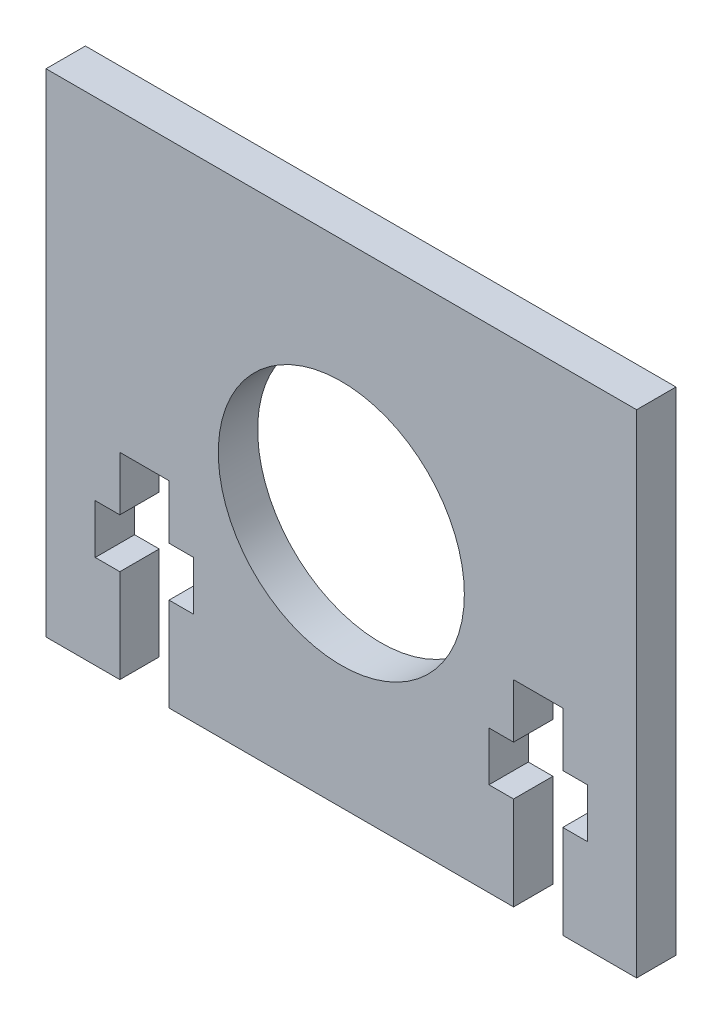
ISO-10303-21;
HEADER;
FILE_DESCRIPTION(('STEP AP214'),'2;1');
FILE_NAME('part.step','',(''),(''),'','','');
FILE_SCHEMA(('AUTOMOTIVE_DESIGN { 1 0 10303 214 1 1 1 1 }'));
ENDSEC;
DATA;
#1=APPLICATION_CONTEXT('core data for automotive mechanical design processes');
#2=APPLICATION_PROTOCOL_DEFINITION('international standard','automotive_design',2000,#1);
#3=PRODUCT_CONTEXT('',#1,'mechanical');
#4=PRODUCT('Part','Part','',(#3));
#5=PRODUCT_RELATED_PRODUCT_CATEGORY('part','',(#4));
#6=PRODUCT_DEFINITION_FORMATION('','',#4);
#7=PRODUCT_DEFINITION_CONTEXT('part definition',#1,'design');
#8=PRODUCT_DEFINITION('design','',#6,#7);
#9=PRODUCT_DEFINITION_SHAPE('','',#8);
#10=(LENGTH_UNIT() NAMED_UNIT(*) SI_UNIT(.MILLI.,.METRE.));
#11=(NAMED_UNIT(*) PLANE_ANGLE_UNIT() SI_UNIT($,.RADIAN.));
#12=(NAMED_UNIT(*) SI_UNIT($,.STERADIAN.) SOLID_ANGLE_UNIT());
#13=UNCERTAINTY_MEASURE_WITH_UNIT(LENGTH_MEASURE(1.E-05),#10,'distance_accuracy_value','');
#14=(GEOMETRIC_REPRESENTATION_CONTEXT(3) GLOBAL_UNCERTAINTY_ASSIGNED_CONTEXT((#13)) GLOBAL_UNIT_ASSIGNED_CONTEXT((#10,
#11,#12)) REPRESENTATION_CONTEXT('',''));
#15=CARTESIAN_POINT('',(0.,0.,0.));
#16=DIRECTION('',(0.,0.,1.));
#17=DIRECTION('',(1.,0.,0.));
#18=AXIS2_PLACEMENT_3D('',#15,#16,#17);
#19=CARTESIAN_POINT('',(30.,-24.9999999999997,4.));
#20=DIRECTION('',(0.,1.,0.));
#21=DIRECTION('',(-1.,0.,0.));
#22=AXIS2_PLACEMENT_3D('',#19,#20,#21);
#23=PLANE('',#22);
#24=DIRECTION('',(1.,0.,0.));
#25=VECTOR('',#24,1.);
#26=CARTESIAN_POINT('',(30.,-24.9999999999997,0.));
#27=LINE('',#26,#25);
#28=CARTESIAN_POINT('',(-17.5,-24.9999999999997,0.));
#29=VERTEX_POINT('',#28);
#30=CARTESIAN_POINT('',(17.5,-24.9999999999997,0.));
#31=VERTEX_POINT('',#30);
#32=EDGE_CURVE('E237',#29,#31,#27,.T.);
#33=ORIENTED_EDGE('',*,*,#32,.T.);
#34=DIRECTION('',(0.,0.,1.));
#35=VECTOR('',#34,1.);
#36=CARTESIAN_POINT('',(17.5,-24.9999999999997,0.));
#37=LINE('',#36,#35);
#38=CARTESIAN_POINT('',(17.5,-24.9999999999997,4.));
#39=VERTEX_POINT('',#38);
#40=EDGE_CURVE('E219',#31,#39,#37,.T.);
#41=ORIENTED_EDGE('',*,*,#40,.T.);
#42=DIRECTION('',(1.,0.,0.));
#43=VECTOR('',#42,1.);
#44=CARTESIAN_POINT('',(30.,-24.9999999999997,4.));
#45=LINE('',#44,#43);
#46=CARTESIAN_POINT('',(-17.5,-24.9999999999997,4.));
#47=VERTEX_POINT('',#46);
#48=EDGE_CURVE('E288',#47,#39,#45,.T.);
#49=ORIENTED_EDGE('',*,*,#48,.F.);
#50=DIRECTION('',(0.,0.,1.));
#51=VECTOR('',#50,1.);
#52=CARTESIAN_POINT('',(-17.5,-24.9999999999997,0.));
#53=LINE('',#52,#51);
#54=EDGE_CURVE('E242',#29,#47,#53,.T.);
#55=ORIENTED_EDGE('',*,*,#54,.F.);
#56=EDGE_LOOP('',(#33,#41,#49,#55));
#57=FACE_BOUND('',#56,.T.);
#58=ADVANCED_FACE('F34',(#57),#23,.F.);
#59=CARTESIAN_POINT('',(-30.,-24.9999999999997,0.));
#60=VERTEX_POINT('',#59);
#61=CARTESIAN_POINT('',(-22.5,-24.9999999999997,0.));
#62=VERTEX_POINT('',#61);
#63=EDGE_CURVE('E243',#60,#62,#27,.T.);
#64=ORIENTED_EDGE('',*,*,#63,.T.);
#65=DIRECTION('',(0.,0.,1.));
#66=VECTOR('',#65,1.);
#67=CARTESIAN_POINT('',(-22.5,-24.9999999999997,0.));
#68=LINE('',#67,#66);
#69=CARTESIAN_POINT('',(-22.5,-24.9999999999997,4.));
#70=VERTEX_POINT('',#69);
#71=EDGE_CURVE('E340',#62,#70,#68,.T.);
#72=ORIENTED_EDGE('',*,*,#71,.T.);
#73=CARTESIAN_POINT('',(-30.,-24.9999999999997,4.));
#74=VERTEX_POINT('',#73);
#75=EDGE_CURVE('E290',#74,#70,#45,.T.);
#76=ORIENTED_EDGE('',*,*,#75,.F.);
#77=DIRECTION('',(0.,0.,-1.));
#78=VECTOR('',#77,1.);
#79=CARTESIAN_POINT('',(-30.,-24.9999999999997,4.));
#80=LINE('',#79,#78);
#81=EDGE_CURVE('E11',#74,#60,#80,.T.);
#82=ORIENTED_EDGE('',*,*,#81,.T.);
#83=EDGE_LOOP('',(#64,#72,#76,#82));
#84=FACE_BOUND('',#83,.T.);
#85=ADVANCED_FACE('F416',(#84),#23,.F.);
#86=CARTESIAN_POINT('',(0.,0.,4.));
#87=DIRECTION('',(0.,0.,-1.));
#88=DIRECTION('',(-1.,0.,0.));
#89=AXIS2_PLACEMENT_3D('',#86,#87,#88);
#90=PLANE('',#89);
#91=ORIENTED_EDGE('',*,*,#48,.T.);
#92=DIRECTION('',(0.,-1.,0.));
#93=VECTOR('',#92,1.);
#94=CARTESIAN_POINT('',(17.5,-15.4999999999997,4.));
#95=LINE('',#94,#93);
#96=CARTESIAN_POINT('',(17.5,-15.4999999999997,4.));
#97=VERTEX_POINT('',#96);
#98=EDGE_CURVE('E225',#97,#39,#95,.T.);
#99=ORIENTED_EDGE('',*,*,#98,.F.);
#100=DIRECTION('',(1.,0.,0.));
#101=VECTOR('',#100,1.);
#102=CARTESIAN_POINT('',(17.5,-15.4999999999997,4.));
#103=LINE('',#102,#101);
#104=CARTESIAN_POINT('',(15.,-15.4999999999997,4.));
#105=VERTEX_POINT('',#104);
#106=EDGE_CURVE('E240',#105,#97,#103,.T.);
#107=ORIENTED_EDGE('',*,*,#106,.F.);
#108=DIRECTION('',(0.,-1.,0.));
#109=VECTOR('',#108,1.);
#110=CARTESIAN_POINT('',(15.,-15.4999999999997,4.));
#111=LINE('',#110,#109);
#112=CARTESIAN_POINT('',(15.,-10.4999999999997,4.));
#113=VERTEX_POINT('',#112);
#114=EDGE_CURVE('E796',#113,#105,#111,.T.);
#115=ORIENTED_EDGE('',*,*,#114,.F.);
#116=DIRECTION('',(-1.,0.,0.));
#117=VECTOR('',#116,1.);
#118=CARTESIAN_POINT('',(17.5,-10.4999999999997,4.));
#119=LINE('',#118,#117);
#120=CARTESIAN_POINT('',(17.5,-10.4999999999997,4.));
#121=VERTEX_POINT('',#120);
#122=EDGE_CURVE('E793',#121,#113,#119,.T.);
#123=ORIENTED_EDGE('',*,*,#122,.F.);
#124=DIRECTION('',(0.,-1.,0.));
#125=VECTOR('',#124,1.);
#126=CARTESIAN_POINT('',(17.5,-4.99999999999974,4.));
#127=LINE('',#126,#125);
#128=CARTESIAN_POINT('',(17.5,-4.99999999999974,4.));
#129=VERTEX_POINT('',#128);
#130=EDGE_CURVE('E790',#129,#121,#127,.T.);
#131=ORIENTED_EDGE('',*,*,#130,.F.);
#132=DIRECTION('',(-1.,0.,0.));
#133=VECTOR('',#132,1.);
#134=CARTESIAN_POINT('',(22.5,-4.99999999999974,4.));
#135=LINE('',#134,#133);
#136=CARTESIAN_POINT('',(22.5,-4.99999999999974,4.));
#137=VERTEX_POINT('',#136);
#138=EDGE_CURVE('E787',#137,#129,#135,.T.);
#139=ORIENTED_EDGE('',*,*,#138,.F.);
#140=DIRECTION('',(0.,1.,0.));
#141=VECTOR('',#140,1.);
#142=CARTESIAN_POINT('',(22.5,-4.99999999999974,4.));
#143=LINE('',#142,#141);
#144=CARTESIAN_POINT('',(22.5,-10.4999999999997,4.));
#145=VERTEX_POINT('',#144);
#146=EDGE_CURVE('E784',#145,#137,#143,.T.);
#147=ORIENTED_EDGE('',*,*,#146,.F.);
#148=DIRECTION('',(-1.,0.,0.));
#149=VECTOR('',#148,1.);
#150=CARTESIAN_POINT('',(25.,-10.4999999999997,4.));
#151=LINE('',#150,#149);
#152=CARTESIAN_POINT('',(25.,-10.4999999999997,4.));
#153=VERTEX_POINT('',#152);
#154=EDGE_CURVE('E781',#153,#145,#151,.T.);
#155=ORIENTED_EDGE('',*,*,#154,.F.);
#156=DIRECTION('',(0.,1.,0.));
#157=VECTOR('',#156,1.);
#158=CARTESIAN_POINT('',(25.,-15.4999999999997,4.));
#159=LINE('',#158,#157);
#160=CARTESIAN_POINT('',(25.,-15.4999999999997,4.));
#161=VERTEX_POINT('',#160);
#162=EDGE_CURVE('E778',#161,#153,#159,.T.);
#163=ORIENTED_EDGE('',*,*,#162,.F.);
#164=DIRECTION('',(1.,0.,0.));
#165=VECTOR('',#164,1.);
#166=CARTESIAN_POINT('',(25.,-15.4999999999997,4.));
#167=LINE('',#166,#165);
#168=CARTESIAN_POINT('',(22.5,-15.4999999999997,4.));
#169=VERTEX_POINT('',#168);
#170=EDGE_CURVE('E771',#169,#161,#167,.T.);
#171=ORIENTED_EDGE('',*,*,#170,.F.);
#172=DIRECTION('',(0.,1.,0.));
#173=VECTOR('',#172,1.);
#174=CARTESIAN_POINT('',(22.5,-15.4999999999997,4.));
#175=LINE('',#174,#173);
#176=CARTESIAN_POINT('',(22.5,-24.9999999999997,4.));
#177=VERTEX_POINT('',#176);
#178=EDGE_CURVE('E300',#177,#169,#175,.T.);
#179=ORIENTED_EDGE('',*,*,#178,.F.);
#180=CARTESIAN_POINT('',(30.,-24.9999999999997,4.));
#181=VERTEX_POINT('',#180);
#182=EDGE_CURVE('E286',#177,#181,#45,.T.);
#183=ORIENTED_EDGE('',*,*,#182,.T.);
#184=DIRECTION('',(0.,1.,0.));
#185=VECTOR('',#184,1.);
#186=CARTESIAN_POINT('',(30.,25.0000000000003,4.));
#187=LINE('',#186,#185);
#188=CARTESIAN_POINT('',(30.,25.0000000000003,4.));
#189=VERTEX_POINT('',#188);
#190=EDGE_CURVE('E269',#181,#189,#187,.T.);
#191=ORIENTED_EDGE('',*,*,#190,.T.);
#192=DIRECTION('',(-1.,0.,0.));
#193=VECTOR('',#192,1.);
#194=CARTESIAN_POINT('',(30.,25.0000000000003,4.));
#195=LINE('',#194,#193);
#196=CARTESIAN_POINT('',(-30.,25.0000000000003,4.));
#197=VERTEX_POINT('',#196);
#198=EDGE_CURVE('E260',#189,#197,#195,.T.);
#199=ORIENTED_EDGE('',*,*,#198,.T.);
#200=DIRECTION('',(0.,-1.,0.));
#201=VECTOR('',#200,1.);
#202=CARTESIAN_POINT('',(-30.,25.0000000000003,4.));
#203=LINE('',#202,#201);
#204=EDGE_CURVE('E255',#197,#74,#203,.T.);
#205=ORIENTED_EDGE('',*,*,#204,.T.);
#206=ORIENTED_EDGE('',*,*,#75,.T.);
#207=DIRECTION('',(0.,-1.,0.));
#208=VECTOR('',#207,1.);
#209=CARTESIAN_POINT('',(-22.5,-15.4999999999997,4.));
#210=LINE('',#209,#208);
#211=CARTESIAN_POINT('',(-22.5,-15.4999999999997,4.));
#212=VERTEX_POINT('',#211);
#213=EDGE_CURVE('E341',#212,#70,#210,.T.);
#214=ORIENTED_EDGE('',*,*,#213,.F.);
#215=DIRECTION('',(1.,0.,0.));
#216=VECTOR('',#215,1.);
#217=CARTESIAN_POINT('',(-22.5,-15.4999999999997,4.));
#218=LINE('',#217,#216);
#219=CARTESIAN_POINT('',(-25.,-15.4999999999997,4.));
#220=VERTEX_POINT('',#219);
#221=EDGE_CURVE('E311',#220,#212,#218,.T.);
#222=ORIENTED_EDGE('',*,*,#221,.F.);
#223=DIRECTION('',(0.,-1.,0.));
#224=VECTOR('',#223,1.);
#225=CARTESIAN_POINT('',(-25.,-10.4999999999997,4.));
#226=LINE('',#225,#224);
#227=CARTESIAN_POINT('',(-25.,-10.4999999999997,4.));
#228=VERTEX_POINT('',#227);
#229=EDGE_CURVE('E368',#228,#220,#226,.T.);
#230=ORIENTED_EDGE('',*,*,#229,.F.);
#231=DIRECTION('',(-1.,0.,0.));
#232=VECTOR('',#231,1.);
#233=CARTESIAN_POINT('',(-22.5,-10.4999999999997,4.));
#234=LINE('',#233,#232);
#235=CARTESIAN_POINT('',(-22.5,-10.4999999999997,4.));
#236=VERTEX_POINT('',#235);
#237=EDGE_CURVE('E365',#236,#228,#234,.T.);
#238=ORIENTED_EDGE('',*,*,#237,.F.);
#239=DIRECTION('',(0.,-1.,0.));
#240=VECTOR('',#239,1.);
#241=CARTESIAN_POINT('',(-22.5,-4.99999999999974,4.));
#242=LINE('',#241,#240);
#243=CARTESIAN_POINT('',(-22.5,-4.99999999999974,4.));
#244=VERTEX_POINT('',#243);
#245=EDGE_CURVE('E362',#244,#236,#242,.T.);
#246=ORIENTED_EDGE('',*,*,#245,.F.);
#247=DIRECTION('',(-1.,0.,0.));
#248=VECTOR('',#247,1.);
#249=CARTESIAN_POINT('',(-17.5,-4.99999999999974,4.));
#250=LINE('',#249,#248);
#251=CARTESIAN_POINT('',(-17.5,-4.99999999999974,4.));
#252=VERTEX_POINT('',#251);
#253=EDGE_CURVE('E359',#252,#244,#250,.T.);
#254=ORIENTED_EDGE('',*,*,#253,.F.);
#255=DIRECTION('',(0.,1.,0.));
#256=VECTOR('',#255,1.);
#257=CARTESIAN_POINT('',(-17.5,-4.99999999999974,4.));
#258=LINE('',#257,#256);
#259=CARTESIAN_POINT('',(-17.5,-10.4999999999997,4.));
#260=VERTEX_POINT('',#259);
#261=EDGE_CURVE('E356',#260,#252,#258,.T.);
#262=ORIENTED_EDGE('',*,*,#261,.F.);
#263=DIRECTION('',(-1.,0.,0.));
#264=VECTOR('',#263,1.);
#265=CARTESIAN_POINT('',(-15.,-10.4999999999997,4.));
#266=LINE('',#265,#264);
#267=CARTESIAN_POINT('',(-15.,-10.4999999999997,4.));
#268=VERTEX_POINT('',#267);
#269=EDGE_CURVE('E353',#268,#260,#266,.T.);
#270=ORIENTED_EDGE('',*,*,#269,.F.);
#271=DIRECTION('',(0.,1.,0.));
#272=VECTOR('',#271,1.);
#273=CARTESIAN_POINT('',(-15.,-10.4999999999997,4.));
#274=LINE('',#273,#272);
#275=CARTESIAN_POINT('',(-15.,-15.4999999999997,4.));
#276=VERTEX_POINT('',#275);
#277=EDGE_CURVE('E350',#276,#268,#274,.T.);
#278=ORIENTED_EDGE('',*,*,#277,.F.);
#279=DIRECTION('',(1.,0.,0.));
#280=VECTOR('',#279,1.);
#281=CARTESIAN_POINT('',(-15.,-15.4999999999997,4.));
#282=LINE('',#281,#280);
#283=CARTESIAN_POINT('',(-17.5,-15.4999999999997,4.));
#284=VERTEX_POINT('',#283);
#285=EDGE_CURVE('E347',#284,#276,#282,.T.);
#286=ORIENTED_EDGE('',*,*,#285,.F.);
#287=DIRECTION('',(0.,1.,0.));
#288=VECTOR('',#287,1.);
#289=CARTESIAN_POINT('',(-17.5,-15.4999999999997,4.));
#290=LINE('',#289,#288);
#291=EDGE_CURVE('E343',#47,#284,#290,.T.);
#292=ORIENTED_EDGE('',*,*,#291,.F.);
#293=EDGE_LOOP('',(#91,#99,#107,#115,#123,#131,#139,#147,#155,#163,#171,#179,#183,#191,#199,
#205,#206,#214,#222,#230,#238,#246,#254,#262,#270,#278,#286,#292));
#294=FACE_BOUND('',#293,.T.);
#295=CARTESIAN_POINT('',(0.,0.,4.));
#296=DIRECTION('',(0.,0.,1.));
#297=DIRECTION('',(1.,0.,0.));
#298=AXIS2_PLACEMENT_3D('',#295,#296,#297);
#299=CIRCLE('',#298,12.5);
#300=CARTESIAN_POINT('',(12.5,0.,4.));
#301=VERTEX_POINT('',#300);
#302=EDGE_CURVE('E395',#301,#301,#299,.T.);
#303=ORIENTED_EDGE('',*,*,#302,.F.);
#304=EDGE_LOOP('',(#303));
#305=FACE_BOUND('',#304,.T.);
#306=ADVANCED_FACE('F295',(#294,#305),#90,.F.);
#307=CARTESIAN_POINT('',(0.,0.,0.));
#308=DIRECTION('',(0.,0.,-1.));
#309=DIRECTION('',(-1.,0.,0.));
#310=AXIS2_PLACEMENT_3D('',#307,#308,#309);
#311=PLANE('',#310);
#312=DIRECTION('',(0.,-1.,0.));
#313=VECTOR('',#312,1.);
#314=CARTESIAN_POINT('',(17.5,-15.4999999999997,0.));
#315=LINE('',#314,#313);
#316=CARTESIAN_POINT('',(17.5,-15.4999999999997,0.));
#317=VERTEX_POINT('',#316);
#318=EDGE_CURVE('E222',#317,#31,#315,.T.);
#319=ORIENTED_EDGE('',*,*,#318,.T.);
#320=ORIENTED_EDGE('',*,*,#32,.F.);
#321=DIRECTION('',(0.,1.,0.));
#322=VECTOR('',#321,1.);
#323=CARTESIAN_POINT('',(-17.5,-15.4999999999997,0.));
#324=LINE('',#323,#322);
#325=CARTESIAN_POINT('',(-17.5,-15.4999999999997,0.));
#326=VERTEX_POINT('',#325);
#327=EDGE_CURVE('E57',#29,#326,#324,.T.);
#328=ORIENTED_EDGE('',*,*,#327,.T.);
#329=DIRECTION('',(1.,0.,0.));
#330=VECTOR('',#329,1.);
#331=CARTESIAN_POINT('',(-15.,-15.4999999999997,0.));
#332=LINE('',#331,#330);
#333=CARTESIAN_POINT('',(-15.,-15.4999999999997,0.));
#334=VERTEX_POINT('',#333);
#335=EDGE_CURVE('E313',#326,#334,#332,.T.);
#336=ORIENTED_EDGE('',*,*,#335,.T.);
#337=DIRECTION('',(0.,1.,0.));
#338=VECTOR('',#337,1.);
#339=CARTESIAN_POINT('',(-15.,-10.4999999999997,0.));
#340=LINE('',#339,#338);
#341=CARTESIAN_POINT('',(-15.,-10.4999999999997,0.));
#342=VERTEX_POINT('',#341);
#343=EDGE_CURVE('E316',#334,#342,#340,.T.);
#344=ORIENTED_EDGE('',*,*,#343,.T.);
#345=DIRECTION('',(-1.,0.,0.));
#346=VECTOR('',#345,1.);
#347=CARTESIAN_POINT('',(-15.,-10.4999999999997,0.));
#348=LINE('',#347,#346);
#349=CARTESIAN_POINT('',(-17.5,-10.4999999999997,0.));
#350=VERTEX_POINT('',#349);
#351=EDGE_CURVE('E319',#342,#350,#348,.T.);
#352=ORIENTED_EDGE('',*,*,#351,.T.);
#353=DIRECTION('',(0.,1.,0.));
#354=VECTOR('',#353,1.);
#355=CARTESIAN_POINT('',(-17.5,-4.99999999999974,0.));
#356=LINE('',#355,#354);
#357=CARTESIAN_POINT('',(-17.5,-4.99999999999974,0.));
#358=VERTEX_POINT('',#357);
#359=EDGE_CURVE('E322',#350,#358,#356,.T.);
#360=ORIENTED_EDGE('',*,*,#359,.T.);
#361=DIRECTION('',(-1.,0.,0.));
#362=VECTOR('',#361,1.);
#363=CARTESIAN_POINT('',(-17.5,-4.99999999999974,0.));
#364=LINE('',#363,#362);
#365=CARTESIAN_POINT('',(-22.5,-4.99999999999974,0.));
#366=VERTEX_POINT('',#365);
#367=EDGE_CURVE('E325',#358,#366,#364,.T.);
#368=ORIENTED_EDGE('',*,*,#367,.T.);
#369=DIRECTION('',(0.,-1.,0.));
#370=VECTOR('',#369,1.);
#371=CARTESIAN_POINT('',(-22.5,-4.99999999999974,0.));
#372=LINE('',#371,#370);
#373=CARTESIAN_POINT('',(-22.5,-10.4999999999997,0.));
#374=VERTEX_POINT('',#373);
#375=EDGE_CURVE('E328',#366,#374,#372,.T.);
#376=ORIENTED_EDGE('',*,*,#375,.T.);
#377=DIRECTION('',(-1.,0.,0.));
#378=VECTOR('',#377,1.);
#379=CARTESIAN_POINT('',(-22.5,-10.4999999999997,0.));
#380=LINE('',#379,#378);
#381=CARTESIAN_POINT('',(-25.,-10.4999999999997,0.));
#382=VERTEX_POINT('',#381);
#383=EDGE_CURVE('E331',#374,#382,#380,.T.);
#384=ORIENTED_EDGE('',*,*,#383,.T.);
#385=DIRECTION('',(0.,-1.,0.));
#386=VECTOR('',#385,1.);
#387=CARTESIAN_POINT('',(-25.,-10.4999999999997,0.));
#388=LINE('',#387,#386);
#389=CARTESIAN_POINT('',(-25.,-15.4999999999997,0.));
#390=VERTEX_POINT('',#389);
#391=EDGE_CURVE('E334',#382,#390,#388,.T.);
#392=ORIENTED_EDGE('',*,*,#391,.T.);
#393=DIRECTION('',(1.,0.,0.));
#394=VECTOR('',#393,1.);
#395=CARTESIAN_POINT('',(-22.5,-15.4999999999997,0.));
#396=LINE('',#395,#394);
#397=CARTESIAN_POINT('',(-22.5,-15.4999999999997,0.));
#398=VERTEX_POINT('',#397);
#399=EDGE_CURVE('E337',#390,#398,#396,.T.);
#400=ORIENTED_EDGE('',*,*,#399,.T.);
#401=DIRECTION('',(0.,-1.,0.));
#402=VECTOR('',#401,1.);
#403=CARTESIAN_POINT('',(-22.5,-15.4999999999997,0.));
#404=LINE('',#403,#402);
#405=EDGE_CURVE('E308',#398,#62,#404,.T.);
#406=ORIENTED_EDGE('',*,*,#405,.T.);
#407=ORIENTED_EDGE('',*,*,#63,.F.);
#408=DIRECTION('',(0.,-1.,0.));
#409=VECTOR('',#408,1.);
#410=CARTESIAN_POINT('',(-30.,25.0000000000003,0.));
#411=LINE('',#410,#409);
#412=CARTESIAN_POINT('',(-30.,25.0000000000003,0.));
#413=VERTEX_POINT('',#412);
#414=EDGE_CURVE('E248',#413,#60,#411,.T.);
#415=ORIENTED_EDGE('',*,*,#414,.F.);
#416=DIRECTION('',(-1.,0.,0.));
#417=VECTOR('',#416,1.);
#418=CARTESIAN_POINT('',(30.,25.0000000000003,0.));
#419=LINE('',#418,#417);
#420=CARTESIAN_POINT('',(30.,25.0000000000003,0.));
#421=VERTEX_POINT('',#420);
#422=EDGE_CURVE('E253',#421,#413,#419,.T.);
#423=ORIENTED_EDGE('',*,*,#422,.F.);
#424=DIRECTION('',(0.,1.,0.));
#425=VECTOR('',#424,1.);
#426=CARTESIAN_POINT('',(30.,25.0000000000003,0.));
#427=LINE('',#426,#425);
#428=CARTESIAN_POINT('',(30.,-24.9999999999997,0.));
#429=VERTEX_POINT('',#428);
#430=EDGE_CURVE('E247',#429,#421,#427,.T.);
#431=ORIENTED_EDGE('',*,*,#430,.F.);
#432=CARTESIAN_POINT('',(22.5,-24.9999999999997,0.));
#433=VERTEX_POINT('',#432);
#434=EDGE_CURVE('E244',#433,#429,#27,.T.);
#435=ORIENTED_EDGE('',*,*,#434,.F.);
#436=DIRECTION('',(0.,1.,0.));
#437=VECTOR('',#436,1.);
#438=CARTESIAN_POINT('',(22.5,-15.4999999999997,0.));
#439=LINE('',#438,#437);
#440=CARTESIAN_POINT('',(22.5,-15.4999999999997,0.));
#441=VERTEX_POINT('',#440);
#442=EDGE_CURVE('E49',#433,#441,#439,.T.);
#443=ORIENTED_EDGE('',*,*,#442,.T.);
#444=DIRECTION('',(1.,0.,0.));
#445=VECTOR('',#444,1.);
#446=CARTESIAN_POINT('',(25.,-15.4999999999997,0.));
#447=LINE('',#446,#445);
#448=CARTESIAN_POINT('',(25.,-15.4999999999997,0.));
#449=VERTEX_POINT('',#448);
#450=EDGE_CURVE('E830',#441,#449,#447,.T.);
#451=ORIENTED_EDGE('',*,*,#450,.T.);
#452=DIRECTION('',(0.,1.,0.));
#453=VECTOR('',#452,1.);
#454=CARTESIAN_POINT('',(25.,-15.4999999999997,0.));
#455=LINE('',#454,#453);
#456=CARTESIAN_POINT('',(25.,-10.4999999999997,0.));
#457=VERTEX_POINT('',#456);
#458=EDGE_CURVE('E818',#449,#457,#455,.T.);
#459=ORIENTED_EDGE('',*,*,#458,.T.);
#460=DIRECTION('',(-1.,0.,0.));
#461=VECTOR('',#460,1.);
#462=CARTESIAN_POINT('',(25.,-10.4999999999997,0.));
#463=LINE('',#462,#461);
#464=CARTESIAN_POINT('',(22.5,-10.4999999999997,0.));
#465=VERTEX_POINT('',#464);
#466=EDGE_CURVE('E826',#457,#465,#463,.T.);
#467=ORIENTED_EDGE('',*,*,#466,.T.);
#468=DIRECTION('',(0.,1.,0.));
#469=VECTOR('',#468,1.);
#470=CARTESIAN_POINT('',(22.5,-4.99999999999974,0.));
#471=LINE('',#470,#469);
#472=CARTESIAN_POINT('',(22.5,-4.99999999999974,0.));
#473=VERTEX_POINT('',#472);
#474=EDGE_CURVE('E828',#465,#473,#471,.T.);
#475=ORIENTED_EDGE('',*,*,#474,.T.);
#476=DIRECTION('',(-1.,0.,0.));
#477=VECTOR('',#476,1.);
#478=CARTESIAN_POINT('',(22.5,-4.99999999999974,0.));
#479=LINE('',#478,#477);
#480=CARTESIAN_POINT('',(17.5,-4.99999999999974,0.));
#481=VERTEX_POINT('',#480);
#482=EDGE_CURVE('E836',#473,#481,#479,.T.);
#483=ORIENTED_EDGE('',*,*,#482,.T.);
#484=DIRECTION('',(0.,-1.,0.));
#485=VECTOR('',#484,1.);
#486=CARTESIAN_POINT('',(17.5,-4.99999999999974,0.));
#487=LINE('',#486,#485);
#488=CARTESIAN_POINT('',(17.5,-10.4999999999997,0.));
#489=VERTEX_POINT('',#488);
#490=EDGE_CURVE('E839',#481,#489,#487,.T.);
#491=ORIENTED_EDGE('',*,*,#490,.T.);
#492=DIRECTION('',(-1.,0.,0.));
#493=VECTOR('',#492,1.);
#494=CARTESIAN_POINT('',(17.5,-10.4999999999997,0.));
#495=LINE('',#494,#493);
#496=CARTESIAN_POINT('',(15.,-10.4999999999997,0.));
#497=VERTEX_POINT('',#496);
#498=EDGE_CURVE('E842',#489,#497,#495,.T.);
#499=ORIENTED_EDGE('',*,*,#498,.T.);
#500=DIRECTION('',(0.,-1.,0.));
#501=VECTOR('',#500,1.);
#502=CARTESIAN_POINT('',(15.,-15.4999999999997,0.));
#503=LINE('',#502,#501);
#504=CARTESIAN_POINT('',(15.,-15.4999999999997,0.));
#505=VERTEX_POINT('',#504);
#506=EDGE_CURVE('E844',#497,#505,#503,.T.);
#507=ORIENTED_EDGE('',*,*,#506,.T.);
#508=DIRECTION('',(1.,0.,0.));
#509=VECTOR('',#508,1.);
#510=CARTESIAN_POINT('',(17.5,-15.4999999999997,0.));
#511=LINE('',#510,#509);
#512=EDGE_CURVE('E231',#505,#317,#511,.T.);
#513=ORIENTED_EDGE('',*,*,#512,.T.);
#514=EDGE_LOOP('',(#319,#320,#328,#336,#344,#352,#360,#368,#376,#384,#392,#400,#406,#407,#415,
#423,#431,#435,#443,#451,#459,#467,#475,#483,#491,#499,#507,#513));
#515=FACE_BOUND('',#514,.T.);
#516=CARTESIAN_POINT('',(0.,0.,0.));
#517=DIRECTION('',(0.,0.,1.));
#518=DIRECTION('',(1.,0.,0.));
#519=AXIS2_PLACEMENT_3D('',#516,#517,#518);
#520=CIRCLE('',#519,12.5);
#521=CARTESIAN_POINT('',(12.5,0.,0.));
#522=VERTEX_POINT('',#521);
#523=EDGE_CURVE('E292',#522,#522,#520,.T.);
#524=ORIENTED_EDGE('',*,*,#523,.T.);
#525=EDGE_LOOP('',(#524));
#526=FACE_BOUND('',#525,.T.);
#527=ADVANCED_FACE('F235',(#515,#526),#311,.T.);
#528=CARTESIAN_POINT('',(-30.,25.0000000000003,4.));
#529=DIRECTION('',(1.,0.,0.));
#530=DIRECTION('',(0.,0.,-1.));
#531=AXIS2_PLACEMENT_3D('',#528,#529,#530);
#532=PLANE('',#531);
#533=ORIENTED_EDGE('',*,*,#414,.T.);
#534=ORIENTED_EDGE('',*,*,#81,.F.);
#535=ORIENTED_EDGE('',*,*,#204,.F.);
#536=DIRECTION('',(0.,0.,-1.));
#537=VECTOR('',#536,1.);
#538=CARTESIAN_POINT('',(-30.,25.0000000000003,4.));
#539=LINE('',#538,#537);
#540=EDGE_CURVE('E256',#197,#413,#539,.T.);
#541=ORIENTED_EDGE('',*,*,#540,.T.);
#542=EDGE_LOOP('',(#533,#534,#535,#541));
#543=FACE_BOUND('',#542,.T.);
#544=ADVANCED_FACE('F36',(#543),#532,.F.);
#545=ORIENTED_EDGE('',*,*,#182,.F.);
#546=DIRECTION('',(0.,0.,1.));
#547=VECTOR('',#546,1.);
#548=CARTESIAN_POINT('',(22.5,-24.9999999999997,0.));
#549=LINE('',#548,#547);
#550=EDGE_CURVE('E230',#433,#177,#549,.T.);
#551=ORIENTED_EDGE('',*,*,#550,.F.);
#552=ORIENTED_EDGE('',*,*,#434,.T.);
#553=DIRECTION('',(0.,0.,-1.));
#554=VECTOR('',#553,1.);
#555=CARTESIAN_POINT('',(30.,-24.9999999999997,4.));
#556=LINE('',#555,#554);
#557=EDGE_CURVE('E42',#181,#429,#556,.T.);
#558=ORIENTED_EDGE('',*,*,#557,.F.);
#559=EDGE_LOOP('',(#545,#551,#552,#558));
#560=FACE_BOUND('',#559,.T.);
#561=ADVANCED_FACE('F301',(#560),#23,.F.);
#562=CARTESIAN_POINT('',(30.,25.0000000000003,4.));
#563=DIRECTION('',(-1.,0.,0.));
#564=DIRECTION('',(0.,-1.,0.));
#565=AXIS2_PLACEMENT_3D('',#562,#563,#564);
#566=PLANE('',#565);
#567=ORIENTED_EDGE('',*,*,#430,.T.);
#568=DIRECTION('',(0.,0.,-1.));
#569=VECTOR('',#568,1.);
#570=CARTESIAN_POINT('',(30.,25.0000000000003,4.));
#571=LINE('',#570,#569);
#572=EDGE_CURVE('E259',#189,#421,#571,.T.);
#573=ORIENTED_EDGE('',*,*,#572,.F.);
#574=ORIENTED_EDGE('',*,*,#190,.F.);
#575=ORIENTED_EDGE('',*,*,#557,.T.);
#576=EDGE_LOOP('',(#567,#573,#574,#575));
#577=FACE_BOUND('',#576,.T.);
#578=ADVANCED_FACE('F267',(#577),#566,.F.);
#579=CARTESIAN_POINT('',(30.,25.0000000000003,4.));
#580=DIRECTION('',(0.,-1.,0.));
#581=DIRECTION('',(0.,0.,-1.));
#582=AXIS2_PLACEMENT_3D('',#579,#580,#581);
#583=PLANE('',#582);
#584=ORIENTED_EDGE('',*,*,#422,.T.);
#585=ORIENTED_EDGE('',*,*,#540,.F.);
#586=ORIENTED_EDGE('',*,*,#198,.F.);
#587=ORIENTED_EDGE('',*,*,#572,.T.);
#588=EDGE_LOOP('',(#584,#585,#586,#587));
#589=FACE_BOUND('',#588,.T.);
#590=ADVANCED_FACE('F278',(#589),#583,.F.);
#591=CARTESIAN_POINT('',(0.,0.,4.));
#592=DIRECTION('',(0.,0.,-1.));
#593=DIRECTION('',(-1.,0.,0.));
#594=AXIS2_PLACEMENT_3D('',#591,#592,#593);
#595=CYLINDRICAL_SURFACE('',#594,12.5);
#596=ORIENTED_EDGE('',*,*,#302,.T.);
#597=EDGE_LOOP('',(#596));
#598=FACE_BOUND('',#597,.T.);
#599=ORIENTED_EDGE('',*,*,#523,.F.);
#600=EDGE_LOOP('',(#599));
#601=FACE_BOUND('',#600,.T.);
#602=ADVANCED_FACE('F402',(#598,#601),#595,.F.);
#603=CARTESIAN_POINT('',(-22.5,-15.4999999999997,0.));
#604=DIRECTION('',(-1.,0.,0.));
#605=DIRECTION('',(0.,0.,1.));
#606=AXIS2_PLACEMENT_3D('',#603,#604,#605);
#607=PLANE('',#606);
#608=ORIENTED_EDGE('',*,*,#213,.T.);
#609=ORIENTED_EDGE('',*,*,#71,.F.);
#610=ORIENTED_EDGE('',*,*,#405,.F.);
#611=DIRECTION('',(0.,0.,1.));
#612=VECTOR('',#611,1.);
#613=CARTESIAN_POINT('',(-22.5,-15.4999999999997,0.));
#614=LINE('',#613,#612);
#615=EDGE_CURVE('E373',#398,#212,#614,.T.);
#616=ORIENTED_EDGE('',*,*,#615,.T.);
#617=EDGE_LOOP('',(#608,#609,#610,#616));
#618=FACE_BOUND('',#617,.T.);
#619=ADVANCED_FACE('F404',(#618),#607,.F.);
#620=CARTESIAN_POINT('',(-22.5,-15.4999999999997,0.));
#621=DIRECTION('',(0.,-1.,0.));
#622=DIRECTION('',(0.,0.,-1.));
#623=AXIS2_PLACEMENT_3D('',#620,#621,#622);
#624=PLANE('',#623);
#625=ORIENTED_EDGE('',*,*,#221,.T.);
#626=ORIENTED_EDGE('',*,*,#615,.F.);
#627=ORIENTED_EDGE('',*,*,#399,.F.);
#628=DIRECTION('',(0.,0.,1.));
#629=VECTOR('',#628,1.);
#630=CARTESIAN_POINT('',(-25.,-15.4999999999997,0.));
#631=LINE('',#630,#629);
#632=EDGE_CURVE('E375',#390,#220,#631,.T.);
#633=ORIENTED_EDGE('',*,*,#632,.T.);
#634=EDGE_LOOP('',(#625,#626,#627,#633));
#635=FACE_BOUND('',#634,.T.);
#636=ADVANCED_FACE('F410',(#635),#624,.F.);
#637=CARTESIAN_POINT('',(-25.,-10.4999999999997,0.));
#638=DIRECTION('',(-1.,0.,0.));
#639=DIRECTION('',(0.,0.,1.));
#640=AXIS2_PLACEMENT_3D('',#637,#638,#639);
#641=PLANE('',#640);
#642=ORIENTED_EDGE('',*,*,#229,.T.);
#643=ORIENTED_EDGE('',*,*,#632,.F.);
#644=ORIENTED_EDGE('',*,*,#391,.F.);
#645=DIRECTION('',(0.,0.,1.));
#646=VECTOR('',#645,1.);
#647=CARTESIAN_POINT('',(-25.,-10.4999999999997,0.));
#648=LINE('',#647,#646);
#649=EDGE_CURVE('E377',#382,#228,#648,.T.);
#650=ORIENTED_EDGE('',*,*,#649,.T.);
#651=EDGE_LOOP('',(#642,#643,#644,#650));
#652=FACE_BOUND('',#651,.T.);
#653=ADVANCED_FACE('F511',(#652),#641,.F.);
#654=CARTESIAN_POINT('',(-22.5,-10.4999999999997,0.));
#655=DIRECTION('',(0.,1.,0.));
#656=DIRECTION('',(-1.,0.,0.));
#657=AXIS2_PLACEMENT_3D('',#654,#655,#656);
#658=PLANE('',#657);
#659=ORIENTED_EDGE('',*,*,#237,.T.);
#660=ORIENTED_EDGE('',*,*,#649,.F.);
#661=ORIENTED_EDGE('',*,*,#383,.F.);
#662=DIRECTION('',(0.,0.,1.));
#663=VECTOR('',#662,1.);
#664=CARTESIAN_POINT('',(-22.5,-10.4999999999997,0.));
#665=LINE('',#664,#663);
#666=EDGE_CURVE('E379',#374,#236,#665,.T.);
#667=ORIENTED_EDGE('',*,*,#666,.T.);
#668=EDGE_LOOP('',(#659,#660,#661,#667));
#669=FACE_BOUND('',#668,.T.);
#670=ADVANCED_FACE('F516',(#669),#658,.F.);
#671=CARTESIAN_POINT('',(-22.5,-4.99999999999974,0.));
#672=DIRECTION('',(-1.,0.,0.));
#673=DIRECTION('',(0.,0.,1.));
#674=AXIS2_PLACEMENT_3D('',#671,#672,#673);
#675=PLANE('',#674);
#676=ORIENTED_EDGE('',*,*,#245,.T.);
#677=ORIENTED_EDGE('',*,*,#666,.F.);
#678=ORIENTED_EDGE('',*,*,#375,.F.);
#679=DIRECTION('',(0.,0.,1.));
#680=VECTOR('',#679,1.);
#681=CARTESIAN_POINT('',(-22.5,-4.99999999999974,0.));
#682=LINE('',#681,#680);
#683=EDGE_CURVE('E381',#366,#244,#682,.T.);
#684=ORIENTED_EDGE('',*,*,#683,.T.);
#685=EDGE_LOOP('',(#676,#677,#678,#684));
#686=FACE_BOUND('',#685,.T.);
#687=ADVANCED_FACE('F494',(#686),#675,.F.);
#688=CARTESIAN_POINT('',(-17.5,-4.99999999999974,0.));
#689=DIRECTION('',(0.,1.,0.));
#690=DIRECTION('',(-1.,0.,0.));
#691=AXIS2_PLACEMENT_3D('',#688,#689,#690);
#692=PLANE('',#691);
#693=ORIENTED_EDGE('',*,*,#253,.T.);
#694=ORIENTED_EDGE('',*,*,#683,.F.);
#695=ORIENTED_EDGE('',*,*,#367,.F.);
#696=DIRECTION('',(0.,0.,1.));
#697=VECTOR('',#696,1.);
#698=CARTESIAN_POINT('',(-17.5,-4.99999999999974,0.));
#699=LINE('',#698,#697);
#700=EDGE_CURVE('E383',#358,#252,#699,.T.);
#701=ORIENTED_EDGE('',*,*,#700,.T.);
#702=EDGE_LOOP('',(#693,#694,#695,#701));
#703=FACE_BOUND('',#702,.T.);
#704=ADVANCED_FACE('F484',(#703),#692,.F.);
#705=CARTESIAN_POINT('',(-17.5,-4.99999999999974,0.));
#706=DIRECTION('',(1.,0.,0.));
#707=DIRECTION('',(0.,0.,-1.));
#708=AXIS2_PLACEMENT_3D('',#705,#706,#707);
#709=PLANE('',#708);
#710=ORIENTED_EDGE('',*,*,#261,.T.);
#711=ORIENTED_EDGE('',*,*,#700,.F.);
#712=ORIENTED_EDGE('',*,*,#359,.F.);
#713=DIRECTION('',(0.,0.,1.));
#714=VECTOR('',#713,1.);
#715=CARTESIAN_POINT('',(-17.5,-10.4999999999997,0.));
#716=LINE('',#715,#714);
#717=EDGE_CURVE('E385',#350,#260,#716,.T.);
#718=ORIENTED_EDGE('',*,*,#717,.T.);
#719=EDGE_LOOP('',(#710,#711,#712,#718));
#720=FACE_BOUND('',#719,.T.);
#721=ADVANCED_FACE('F479',(#720),#709,.F.);
#722=CARTESIAN_POINT('',(-15.,-10.4999999999997,0.));
#723=DIRECTION('',(0.,1.,0.));
#724=DIRECTION('',(0.,0.,1.));
#725=AXIS2_PLACEMENT_3D('',#722,#723,#724);
#726=PLANE('',#725);
#727=ORIENTED_EDGE('',*,*,#269,.T.);
#728=ORIENTED_EDGE('',*,*,#717,.F.);
#729=ORIENTED_EDGE('',*,*,#351,.F.);
#730=DIRECTION('',(0.,0.,1.));
#731=VECTOR('',#730,1.);
#732=CARTESIAN_POINT('',(-15.,-10.4999999999997,0.));
#733=LINE('',#732,#731);
#734=EDGE_CURVE('E387',#342,#268,#733,.T.);
#735=ORIENTED_EDGE('',*,*,#734,.T.);
#736=EDGE_LOOP('',(#727,#728,#729,#735));
#737=FACE_BOUND('',#736,.T.);
#738=ADVANCED_FACE('F471',(#737),#726,.F.);
#739=CARTESIAN_POINT('',(-15.,-10.4999999999997,0.));
#740=DIRECTION('',(1.,0.,0.));
#741=DIRECTION('',(0.,0.,-1.));
#742=AXIS2_PLACEMENT_3D('',#739,#740,#741);
#743=PLANE('',#742);
#744=ORIENTED_EDGE('',*,*,#277,.T.);
#745=ORIENTED_EDGE('',*,*,#734,.F.);
#746=ORIENTED_EDGE('',*,*,#343,.F.);
#747=DIRECTION('',(0.,0.,1.));
#748=VECTOR('',#747,1.);
#749=CARTESIAN_POINT('',(-15.,-15.4999999999997,0.));
#750=LINE('',#749,#748);
#751=EDGE_CURVE('E389',#334,#276,#750,.T.);
#752=ORIENTED_EDGE('',*,*,#751,.T.);
#753=EDGE_LOOP('',(#744,#745,#746,#752));
#754=FACE_BOUND('',#753,.T.);
#755=ADVANCED_FACE('F466',(#754),#743,.F.);
#756=CARTESIAN_POINT('',(-15.,-15.4999999999997,0.));
#757=DIRECTION('',(0.,-1.,0.));
#758=DIRECTION('',(0.,0.,-1.));
#759=AXIS2_PLACEMENT_3D('',#756,#757,#758);
#760=PLANE('',#759);
#761=ORIENTED_EDGE('',*,*,#285,.T.);
#762=ORIENTED_EDGE('',*,*,#751,.F.);
#763=ORIENTED_EDGE('',*,*,#335,.F.);
#764=DIRECTION('',(0.,0.,1.));
#765=VECTOR('',#764,1.);
#766=CARTESIAN_POINT('',(-17.5,-15.4999999999997,0.));
#767=LINE('',#766,#765);
#768=EDGE_CURVE('E391',#326,#284,#767,.T.);
#769=ORIENTED_EDGE('',*,*,#768,.T.);
#770=EDGE_LOOP('',(#761,#762,#763,#769));
#771=FACE_BOUND('',#770,.T.);
#772=ADVANCED_FACE('F457',(#771),#760,.F.);
#773=CARTESIAN_POINT('',(-17.5,-15.4999999999997,0.));
#774=DIRECTION('',(1.,0.,0.));
#775=DIRECTION('',(0.,0.,-1.));
#776=AXIS2_PLACEMENT_3D('',#773,#774,#775);
#777=PLANE('',#776);
#778=ORIENTED_EDGE('',*,*,#291,.T.);
#779=ORIENTED_EDGE('',*,*,#768,.F.);
#780=ORIENTED_EDGE('',*,*,#327,.F.);
#781=ORIENTED_EDGE('',*,*,#54,.T.);
#782=EDGE_LOOP('',(#778,#779,#780,#781));
#783=FACE_BOUND('',#782,.T.);
#784=ADVANCED_FACE('F452',(#783),#777,.F.);
#785=CARTESIAN_POINT('',(17.5,-15.4999999999997,0.));
#786=DIRECTION('',(-1.,0.,0.));
#787=DIRECTION('',(0.,0.,1.));
#788=AXIS2_PLACEMENT_3D('',#785,#786,#787);
#789=PLANE('',#788);
#790=ORIENTED_EDGE('',*,*,#98,.T.);
#791=ORIENTED_EDGE('',*,*,#40,.F.);
#792=ORIENTED_EDGE('',*,*,#318,.F.);
#793=DIRECTION('',(0.,0.,1.));
#794=VECTOR('',#793,1.);
#795=CARTESIAN_POINT('',(17.5,-15.4999999999997,0.));
#796=LINE('',#795,#794);
#797=EDGE_CURVE('E344',#317,#97,#796,.T.);
#798=ORIENTED_EDGE('',*,*,#797,.T.);
#799=EDGE_LOOP('',(#790,#791,#792,#798));
#800=FACE_BOUND('',#799,.T.);
#801=ADVANCED_FACE('F221',(#800),#789,.F.);
#802=CARTESIAN_POINT('',(17.5,-15.4999999999997,0.));
#803=DIRECTION('',(0.,-1.,0.));
#804=DIRECTION('',(0.,0.,-1.));
#805=AXIS2_PLACEMENT_3D('',#802,#803,#804);
#806=PLANE('',#805);
#807=ORIENTED_EDGE('',*,*,#106,.T.);
#808=ORIENTED_EDGE('',*,*,#797,.F.);
#809=ORIENTED_EDGE('',*,*,#512,.F.);
#810=DIRECTION('',(0.,0.,1.));
#811=VECTOR('',#810,1.);
#812=CARTESIAN_POINT('',(15.,-15.4999999999997,0.));
#813=LINE('',#812,#811);
#814=EDGE_CURVE('E801',#505,#105,#813,.T.);
#815=ORIENTED_EDGE('',*,*,#814,.T.);
#816=EDGE_LOOP('',(#807,#808,#809,#815));
#817=FACE_BOUND('',#816,.T.);
#818=ADVANCED_FACE('F622',(#817),#806,.F.);
#819=CARTESIAN_POINT('',(15.,-15.4999999999997,0.));
#820=DIRECTION('',(-1.,0.,0.));
#821=DIRECTION('',(0.,0.,1.));
#822=AXIS2_PLACEMENT_3D('',#819,#820,#821);
#823=PLANE('',#822);
#824=ORIENTED_EDGE('',*,*,#114,.T.);
#825=ORIENTED_EDGE('',*,*,#814,.F.);
#826=ORIENTED_EDGE('',*,*,#506,.F.);
#827=DIRECTION('',(0.,0.,1.));
#828=VECTOR('',#827,1.);
#829=CARTESIAN_POINT('',(15.,-10.4999999999997,0.));
#830=LINE('',#829,#828);
#831=EDGE_CURVE('E803',#497,#113,#830,.T.);
#832=ORIENTED_EDGE('',*,*,#831,.T.);
#833=EDGE_LOOP('',(#824,#825,#826,#832));
#834=FACE_BOUND('',#833,.T.);
#835=ADVANCED_FACE('F612',(#834),#823,.F.);
#836=CARTESIAN_POINT('',(17.5,-10.4999999999997,0.));
#837=DIRECTION('',(0.,1.,0.));
#838=DIRECTION('',(0.,0.,1.));
#839=AXIS2_PLACEMENT_3D('',#836,#837,#838);
#840=PLANE('',#839);
#841=ORIENTED_EDGE('',*,*,#122,.T.);
#842=ORIENTED_EDGE('',*,*,#831,.F.);
#843=ORIENTED_EDGE('',*,*,#498,.F.);
#844=DIRECTION('',(0.,0.,1.));
#845=VECTOR('',#844,1.);
#846=CARTESIAN_POINT('',(17.5,-10.4999999999997,0.));
#847=LINE('',#846,#845);
#848=EDGE_CURVE('E805',#489,#121,#847,.T.);
#849=ORIENTED_EDGE('',*,*,#848,.T.);
#850=EDGE_LOOP('',(#841,#842,#843,#849));
#851=FACE_BOUND('',#850,.T.);
#852=ADVANCED_FACE('F602',(#851),#840,.F.);
#853=CARTESIAN_POINT('',(17.5,-4.99999999999974,0.));
#854=DIRECTION('',(-1.,0.,0.));
#855=DIRECTION('',(0.,0.,1.));
#856=AXIS2_PLACEMENT_3D('',#853,#854,#855);
#857=PLANE('',#856);
#858=ORIENTED_EDGE('',*,*,#130,.T.);
#859=ORIENTED_EDGE('',*,*,#848,.F.);
#860=ORIENTED_EDGE('',*,*,#490,.F.);
#861=DIRECTION('',(0.,0.,1.));
#862=VECTOR('',#861,1.);
#863=CARTESIAN_POINT('',(17.5,-4.99999999999974,0.));
#864=LINE('',#863,#862);
#865=EDGE_CURVE('E807',#481,#129,#864,.T.);
#866=ORIENTED_EDGE('',*,*,#865,.T.);
#867=EDGE_LOOP('',(#858,#859,#860,#866));
#868=FACE_BOUND('',#867,.T.);
#869=ADVANCED_FACE('F592',(#868),#857,.F.);
#870=CARTESIAN_POINT('',(22.5,-4.99999999999974,0.));
#871=DIRECTION('',(0.,1.,0.));
#872=DIRECTION('',(-1.,0.,0.));
#873=AXIS2_PLACEMENT_3D('',#870,#871,#872);
#874=PLANE('',#873);
#875=ORIENTED_EDGE('',*,*,#138,.T.);
#876=ORIENTED_EDGE('',*,*,#865,.F.);
#877=ORIENTED_EDGE('',*,*,#482,.F.);
#878=DIRECTION('',(0.,0.,1.));
#879=VECTOR('',#878,1.);
#880=CARTESIAN_POINT('',(22.5,-4.99999999999974,0.));
#881=LINE('',#880,#879);
#882=EDGE_CURVE('E809',#473,#137,#881,.T.);
#883=ORIENTED_EDGE('',*,*,#882,.T.);
#884=EDGE_LOOP('',(#875,#876,#877,#883));
#885=FACE_BOUND('',#884,.T.);
#886=ADVANCED_FACE('F582',(#885),#874,.F.);
#887=CARTESIAN_POINT('',(22.5,-4.99999999999974,0.));
#888=DIRECTION('',(1.,0.,0.));
#889=DIRECTION('',(0.,0.,-1.));
#890=AXIS2_PLACEMENT_3D('',#887,#888,#889);
#891=PLANE('',#890);
#892=ORIENTED_EDGE('',*,*,#146,.T.);
#893=ORIENTED_EDGE('',*,*,#882,.F.);
#894=ORIENTED_EDGE('',*,*,#474,.F.);
#895=DIRECTION('',(0.,0.,1.));
#896=VECTOR('',#895,1.);
#897=CARTESIAN_POINT('',(22.5,-10.4999999999997,0.));
#898=LINE('',#897,#896);
#899=EDGE_CURVE('E811',#465,#145,#898,.T.);
#900=ORIENTED_EDGE('',*,*,#899,.T.);
#901=EDGE_LOOP('',(#892,#893,#894,#900));
#902=FACE_BOUND('',#901,.T.);
#903=ADVANCED_FACE('F572',(#902),#891,.F.);
#904=CARTESIAN_POINT('',(25.,-10.4999999999997,0.));
#905=DIRECTION('',(0.,1.,0.));
#906=DIRECTION('',(0.,0.,1.));
#907=AXIS2_PLACEMENT_3D('',#904,#905,#906);
#908=PLANE('',#907);
#909=ORIENTED_EDGE('',*,*,#154,.T.);
#910=ORIENTED_EDGE('',*,*,#899,.F.);
#911=ORIENTED_EDGE('',*,*,#466,.F.);
#912=DIRECTION('',(0.,0.,1.));
#913=VECTOR('',#912,1.);
#914=CARTESIAN_POINT('',(25.,-10.4999999999997,0.));
#915=LINE('',#914,#913);
#916=EDGE_CURVE('E813',#457,#153,#915,.T.);
#917=ORIENTED_EDGE('',*,*,#916,.T.);
#918=EDGE_LOOP('',(#909,#910,#911,#917));
#919=FACE_BOUND('',#918,.T.);
#920=ADVANCED_FACE('F562',(#919),#908,.F.);
#921=CARTESIAN_POINT('',(25.,-15.4999999999997,0.));
#922=DIRECTION('',(1.,0.,0.));
#923=DIRECTION('',(0.,0.,-1.));
#924=AXIS2_PLACEMENT_3D('',#921,#922,#923);
#925=PLANE('',#924);
#926=ORIENTED_EDGE('',*,*,#162,.T.);
#927=ORIENTED_EDGE('',*,*,#916,.F.);
#928=ORIENTED_EDGE('',*,*,#458,.F.);
#929=DIRECTION('',(0.,0.,1.));
#930=VECTOR('',#929,1.);
#931=CARTESIAN_POINT('',(25.,-15.4999999999997,0.));
#932=LINE('',#931,#930);
#933=EDGE_CURVE('E304',#449,#161,#932,.T.);
#934=ORIENTED_EDGE('',*,*,#933,.T.);
#935=EDGE_LOOP('',(#926,#927,#928,#934));
#936=FACE_BOUND('',#935,.T.);
#937=ADVANCED_FACE('F552',(#936),#925,.F.);
#938=CARTESIAN_POINT('',(25.,-15.4999999999997,0.));
#939=DIRECTION('',(0.,-1.,0.));
#940=DIRECTION('',(0.,0.,-1.));
#941=AXIS2_PLACEMENT_3D('',#938,#939,#940);
#942=PLANE('',#941);
#943=ORIENTED_EDGE('',*,*,#170,.T.);
#944=ORIENTED_EDGE('',*,*,#933,.F.);
#945=ORIENTED_EDGE('',*,*,#450,.F.);
#946=DIRECTION('',(0.,0.,1.));
#947=VECTOR('',#946,1.);
#948=CARTESIAN_POINT('',(22.5,-15.4999999999997,0.));
#949=LINE('',#948,#947);
#950=EDGE_CURVE('E302',#441,#169,#949,.T.);
#951=ORIENTED_EDGE('',*,*,#950,.T.);
#952=EDGE_LOOP('',(#943,#944,#945,#951));
#953=FACE_BOUND('',#952,.T.);
#954=ADVANCED_FACE('F543',(#953),#942,.F.);
#955=CARTESIAN_POINT('',(22.5,-15.4999999999997,0.));
#956=DIRECTION('',(1.,0.,0.));
#957=DIRECTION('',(0.,0.,-1.));
#958=AXIS2_PLACEMENT_3D('',#955,#956,#957);
#959=PLANE('',#958);
#960=ORIENTED_EDGE('',*,*,#178,.T.);
#961=ORIENTED_EDGE('',*,*,#950,.F.);
#962=ORIENTED_EDGE('',*,*,#442,.F.);
#963=ORIENTED_EDGE('',*,*,#550,.T.);
#964=EDGE_LOOP('',(#960,#961,#962,#963));
#965=FACE_BOUND('',#964,.T.);
#966=ADVANCED_FACE('F538',(#965),#959,.F.);
#967=CLOSED_SHELL('',(#58,#85,#306,#527,#544,#561,#578,#590,#602,#619,#636,#653,#670,#687,#704,
#721,#738,#755,#772,#784,#801,#818,#835,#852,#869,#886,#903,#920,#937,#954,#966));
#968=MANIFOLD_SOLID_BREP('B2',#967);
#969=ADVANCED_BREP_SHAPE_REPRESENTATION('',(#18,#968),#14);
#970=SHAPE_DEFINITION_REPRESENTATION(#9,#969);
ENDSEC;
END-ISO-10303-21;
